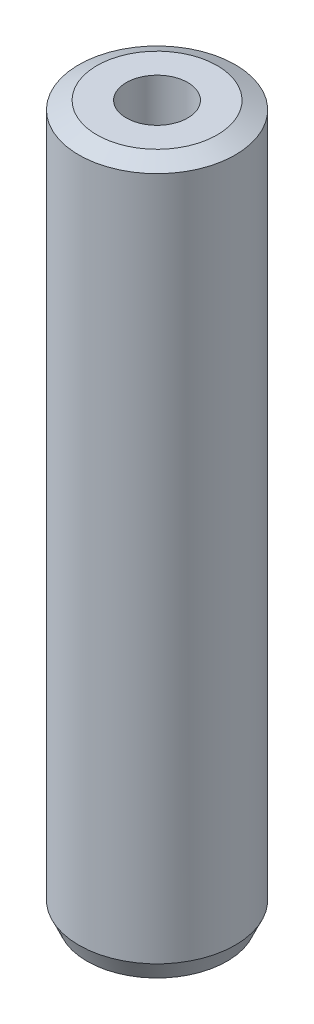
ISO-10303-21;
HEADER;
FILE_DESCRIPTION(('STEP AP214'),'2;1');
FILE_NAME('part.step','',(''),(''),'','','');
FILE_SCHEMA(('AUTOMOTIVE_DESIGN { 1 0 10303 214 1 1 1 1 }'));
ENDSEC;
DATA;
#1=APPLICATION_CONTEXT('core data for automotive mechanical design processes');
#2=APPLICATION_PROTOCOL_DEFINITION('international standard','automotive_design',2000,#1);
#3=PRODUCT_CONTEXT('',#1,'mechanical');
#4=PRODUCT('Part','Part','',(#3));
#5=PRODUCT_RELATED_PRODUCT_CATEGORY('part','',(#4));
#6=PRODUCT_DEFINITION_FORMATION('','',#4);
#7=PRODUCT_DEFINITION_CONTEXT('part definition',#1,'design');
#8=PRODUCT_DEFINITION('design','',#6,#7);
#9=PRODUCT_DEFINITION_SHAPE('','',#8);
#10=(LENGTH_UNIT() NAMED_UNIT(*) SI_UNIT(.MILLI.,.METRE.));
#11=(NAMED_UNIT(*) PLANE_ANGLE_UNIT() SI_UNIT($,.RADIAN.));
#12=(NAMED_UNIT(*) SI_UNIT($,.STERADIAN.) SOLID_ANGLE_UNIT());
#13=UNCERTAINTY_MEASURE_WITH_UNIT(LENGTH_MEASURE(1.E-05),#10,'distance_accuracy_value','');
#14=(GEOMETRIC_REPRESENTATION_CONTEXT(3) GLOBAL_UNCERTAINTY_ASSIGNED_CONTEXT((#13)) GLOBAL_UNIT_ASSIGNED_CONTEXT((#10,
#11,#12)) REPRESENTATION_CONTEXT('',''));
#15=CARTESIAN_POINT('',(0.,0.,0.));
#16=DIRECTION('',(0.,0.,1.));
#17=DIRECTION('',(1.,0.,0.));
#18=AXIS2_PLACEMENT_3D('',#15,#16,#17);
#19=CARTESIAN_POINT('',(0.,317.944374812962,0.));
#20=DIRECTION('',(0.,-1.,0.));
#21=DIRECTION('',(0.,0.,-1.));
#22=AXIS2_PLACEMENT_3D('',#19,#20,#21);
#23=CYLINDRICAL_SURFACE('',#22,35.);
#24=CARTESIAN_POINT('',(0.,314.234923446247,0.));
#25=DIRECTION('',(0.,1.,0.));
#26=DIRECTION('',(0.,0.,1.));
#27=AXIS2_PLACEMENT_3D('',#24,#25,#26);
#28=CIRCLE('',#27,35.);
#29=CARTESIAN_POINT('',(0.,314.234923446247,-35.0000000000001));
#30=VERTEX_POINT('',#29);
#31=EDGE_CURVE('E50',#30,#30,#28,.F.);
#32=ORIENTED_EDGE('',*,*,#31,.T.);
#33=EDGE_LOOP('',(#32));
#34=FACE_BOUND('',#33,.T.);
#35=CARTESIAN_POINT('',(0.,8.11050078247921,0.));
#36=DIRECTION('',(0.,1.,0.));
#37=DIRECTION('',(0.,0.,1.));
#38=AXIS2_PLACEMENT_3D('',#35,#36,#37);
#39=CIRCLE('',#38,35.);
#40=CARTESIAN_POINT('',(0.,8.11050078247921,35.));
#41=VERTEX_POINT('',#40);
#42=EDGE_CURVE('E51',#41,#41,#39,.T.);
#43=ORIENTED_EDGE('',*,*,#42,.T.);
#44=EDGE_LOOP('',(#43));
#45=FACE_BOUND('',#44,.T.);
#46=ADVANCED_FACE('F39',(#34,#45),#23,.T.);
#47=CARTESIAN_POINT('',(0.,317.944374812962,0.));
#48=DIRECTION('',(0.,1.,0.));
#49=DIRECTION('',(0.,0.,1.));
#50=AXIS2_PLACEMENT_3D('',#47,#48,#49);
#51=PLANE('',#50);
#52=CARTESIAN_POINT('',(0.,317.944374812962,0.));
#53=DIRECTION('',(0.,1.,0.));
#54=DIRECTION('',(0.,0.,1.));
#55=AXIS2_PLACEMENT_3D('',#52,#53,#54);
#56=CIRCLE('',#55,26.8894992175207);
#57=CARTESIAN_POINT('',(0.,317.944374812962,-26.8894992175207));
#58=VERTEX_POINT('',#57);
#59=EDGE_CURVE('E54',#58,#58,#56,.T.);
#60=ORIENTED_EDGE('',*,*,#59,.T.);
#61=EDGE_LOOP('',(#60));
#62=FACE_BOUND('',#61,.T.);
#63=CARTESIAN_POINT('',(0.,317.944374812962,0.));
#64=DIRECTION('',(0.,1.,0.));
#65=DIRECTION('',(0.,0.,1.));
#66=AXIS2_PLACEMENT_3D('',#63,#64,#65);
#67=CIRCLE('',#66,13.7501107790412);
#68=CARTESIAN_POINT('',(0.,317.944374812962,13.7501107790412));
#69=VERTEX_POINT('',#68);
#70=EDGE_CURVE('E58',#69,#69,#67,.T.);
#71=ORIENTED_EDGE('',*,*,#70,.F.);
#72=EDGE_LOOP('',(#71));
#73=FACE_BOUND('',#72,.T.);
#74=ADVANCED_FACE('F69',(#62,#73),#51,.T.);
#75=CARTESIAN_POINT('',(0.,0.,0.));
#76=DIRECTION('',(0.,1.,0.));
#77=DIRECTION('',(0.,0.,1.));
#78=AXIS2_PLACEMENT_3D('',#75,#76,#77);
#79=PLANE('',#78);
#80=CARTESIAN_POINT('',(0.,0.,0.));
#81=DIRECTION('',(0.,1.,0.));
#82=DIRECTION('',(0.,0.,1.));
#83=AXIS2_PLACEMENT_3D('',#80,#81,#82);
#84=CIRCLE('',#83,31.2905486332847);
#85=CARTESIAN_POINT('',(0.,0.,31.2905486332847));
#86=VERTEX_POINT('',#85);
#87=EDGE_CURVE('E10',#86,#86,#84,.F.);
#88=ORIENTED_EDGE('',*,*,#87,.T.);
#89=EDGE_LOOP('',(#88));
#90=FACE_BOUND('',#89,.T.);
#91=CARTESIAN_POINT('',(0.,0.,0.));
#92=DIRECTION('',(0.,1.,0.));
#93=DIRECTION('',(0.,0.,1.));
#94=AXIS2_PLACEMENT_3D('',#91,#92,#93);
#95=CIRCLE('',#94,13.7501107790412);
#96=CARTESIAN_POINT('',(0.,0.,13.7501107790412));
#97=VERTEX_POINT('',#96);
#98=EDGE_CURVE('E63',#97,#97,#95,.T.);
#99=ORIENTED_EDGE('',*,*,#98,.T.);
#100=EDGE_LOOP('',(#99));
#101=FACE_BOUND('',#100,.T.);
#102=ADVANCED_FACE('F75',(#90,#101),#79,.F.);
#103=CARTESIAN_POINT('',(0.,317.944374812962,0.));
#104=DIRECTION('',(0.,-1.,0.));
#105=DIRECTION('',(0.,0.,-1.));
#106=AXIS2_PLACEMENT_3D('',#103,#104,#105);
#107=CYLINDRICAL_SURFACE('',#106,13.7501107790412);
#108=ORIENTED_EDGE('',*,*,#70,.T.);
#109=EDGE_LOOP('',(#108));
#110=FACE_BOUND('',#109,.T.);
#111=ORIENTED_EDGE('',*,*,#98,.F.);
#112=EDGE_LOOP('',(#111));
#113=FACE_BOUND('',#112,.T.);
#114=ADVANCED_FACE('F70',(#110,#113),#107,.F.);
#115=CARTESIAN_POINT('',(0.,317.944374812962,0.));
#116=DIRECTION('',(0.,-1.,0.));
#117=DIRECTION('',(0.,0.,-1.));
#118=AXIS2_PLACEMENT_3D('',#115,#116,#117);
#119=CONICAL_SURFACE('',#118,26.8894992175207,1.14183536844898);
#120=CARTESIAN_POINT('',(0.,314.234923446247,-35.0000000000001));
#121=CARTESIAN_POINT('',(0.,314.27356356465,-34.9155156168492));
#122=CARTESIAN_POINT('',(0.,314.312203683054,-34.8310312336984));
#123=CARTESIAN_POINT('',(0.,314.38948391986,-34.6620624673968));
#124=CARTESIAN_POINT('',(0.,314.428124038264,-34.5775780842459));
#125=CARTESIAN_POINT('',(0.,314.50540427507,-34.4086093179443));
#126=CARTESIAN_POINT('',(0.,314.544044393473,-34.3241249347935));
#127=CARTESIAN_POINT('',(0.,314.62132463028,-34.1551561684918));
#128=CARTESIAN_POINT('',(0.,314.659964748683,-34.070671785341));
#129=CARTESIAN_POINT('',(0.,314.73724498549,-33.9017030190393));
#130=CARTESIAN_POINT('',(0.,314.775885103893,-33.8172186358885));
#131=CARTESIAN_POINT('',(0.,314.8531653407,-33.6482498695868));
#132=CARTESIAN_POINT('',(0.,314.891805459103,-33.563765486436));
#133=CARTESIAN_POINT('',(0.,314.969085695909,-33.3947967201344));
#134=CARTESIAN_POINT('',(0.,315.007725814313,-33.3103123369835));
#135=CARTESIAN_POINT('',(0.,315.085006051119,-33.1413435706819));
#136=CARTESIAN_POINT('',(0.,315.123646169523,-33.0568591875311));
#137=CARTESIAN_POINT('',(0.,315.200926406329,-32.8878904212294));
#138=CARTESIAN_POINT('',(0.,315.239566524732,-32.8034060380786));
#139=CARTESIAN_POINT('',(0.,315.316846761539,-32.6344372717769));
#140=CARTESIAN_POINT('',(0.,315.355486879942,-32.5499528886261));
#141=CARTESIAN_POINT('',(0.,315.432767116749,-32.3809841223244));
#142=CARTESIAN_POINT('',(0.,315.471407235152,-32.2964997391736));
#143=CARTESIAN_POINT('',(0.,315.548687471959,-32.127530972872));
#144=CARTESIAN_POINT('',(0.,315.587327590362,-32.0430465897211));
#145=CARTESIAN_POINT('',(0.,315.664607827169,-31.8740778234195));
#146=CARTESIAN_POINT('',(0.,315.703247945572,-31.7895934402687));
#147=CARTESIAN_POINT('',(0.,315.780528182378,-31.620624673967));
#148=CARTESIAN_POINT('',(0.,315.819168300782,-31.5361402908162));
#149=CARTESIAN_POINT('',(0.,315.896448537588,-31.3671715245145));
#150=CARTESIAN_POINT('',(0.,315.935088655992,-31.2826871413637));
#151=CARTESIAN_POINT('',(0.,316.012368892798,-31.113718375062));
#152=CARTESIAN_POINT('',(0.,316.051009011201,-31.0292339919112));
#153=CARTESIAN_POINT('',(0.,316.128289248008,-30.8602652256096));
#154=CARTESIAN_POINT('',(0.,316.166929366411,-30.7757808424587));
#155=CARTESIAN_POINT('',(0.,316.244209603218,-30.6068120761571));
#156=CARTESIAN_POINT('',(0.,316.282849721621,-30.5223276930063));
#157=CARTESIAN_POINT('',(0.,316.360129958428,-30.3533589267046));
#158=CARTESIAN_POINT('',(0.,316.398770076831,-30.2688745435538));
#159=CARTESIAN_POINT('',(0.,316.476050313638,-30.0999057772521));
#160=CARTESIAN_POINT('',(0.,316.514690432041,-30.0154213941013));
#161=CARTESIAN_POINT('',(0.,316.591970668847,-29.8464526277996));
#162=CARTESIAN_POINT('',(0.,316.630610787251,-29.7619682446488));
#163=CARTESIAN_POINT('',(0.,316.707891024057,-29.5929994783472));
#164=CARTESIAN_POINT('',(0.,316.746531142461,-29.5085150951963));
#165=CARTESIAN_POINT('',(0.,316.823811379267,-29.3395463288947));
#166=CARTESIAN_POINT('',(0.,316.86245149767,-29.2550619457439));
#167=CARTESIAN_POINT('',(0.,316.939731734477,-29.0860931794422));
#168=CARTESIAN_POINT('',(0.,316.97837185288,-29.0016087962914));
#169=CARTESIAN_POINT('',(0.,317.055652089687,-28.8326400299897));
#170=CARTESIAN_POINT('',(0.,317.09429220809,-28.7481556468389));
#171=CARTESIAN_POINT('',(0.,317.171572444897,-28.5791868805372));
#172=CARTESIAN_POINT('',(0.,317.2102125633,-28.4947024973864));
#173=CARTESIAN_POINT('',(0.,317.287492800107,-28.3257337310848));
#174=CARTESIAN_POINT('',(0.,317.32613291851,-28.2412493479339));
#175=CARTESIAN_POINT('',(0.,317.403413155316,-28.0722805816323));
#176=CARTESIAN_POINT('',(0.,317.44205327372,-27.9877961984815));
#177=CARTESIAN_POINT('',(0.,317.519333510526,-27.8188274321798));
#178=CARTESIAN_POINT('',(0.,317.55797362893,-27.734343049029));
#179=CARTESIAN_POINT('',(0.,317.635253865736,-27.5653742827273));
#180=CARTESIAN_POINT('',(0.,317.673893984139,-27.4808898995765));
#181=CARTESIAN_POINT('',(0.,317.751174220946,-27.3119211332748));
#182=CARTESIAN_POINT('',(0.,317.789814339349,-27.227436750124));
#183=CARTESIAN_POINT('',(0.,317.867094576156,-27.0584679838224));
#184=CARTESIAN_POINT('',(0.,317.905734694559,-26.9739836006715));
#185=CARTESIAN_POINT('',(0.,317.944374812962,-26.8894992175207));
#186=B_SPLINE_CURVE_WITH_KNOTS('',3,(#120,#121,#122,#123,#124,#125,#126,#127,#128,#129,#130,
#131,#132,#133,#134,#135,#136,#137,#138,#139,#140,#141,#142,#143,#144,#145,#146,#147,#148,#149,
#150,#151,#152,#153,#154,#155,#156,#157,#158,#159,#160,#161,#162,#163,#164,#165,#166,#167,#168,
#169,#170,#171,#172,#173,#174,#175,#176,#177,#178,#179,#180,#181,#182,#183,#184,#185),
.UNSPECIFIED.,.F.,.F.,(4,2,2,2,2,2,2,2,2,2,2,2,2,2,2,2,2,2,2,2,2,2,2,2,2,2,2,2,2,2,2,2,4),(0.,
0.278704193939308,0.557408387878615,0.836112581817922,1.11481677575723,1.39352096969654,
1.67222516363585,1.95092935757516,2.22963355151447,2.50833774545377,2.78704193939309,
3.0657461333324,3.34445032727173,3.62315452121101,3.90185871515034,4.18056290908963,
4.45926710302894,4.73797129696824,5.01667549090755,5.29537968484686,5.57408387878617,
5.85278807272548,6.13149226666479,6.41019646060409,6.68890065454343,6.96760484848274,
7.24630904242205,7.52501323636135,7.80371743030066,8.08242162423997,8.36112581817928,
8.63983001211859,8.9185342060579),.UNSPECIFIED.);
#187=EDGE_CURVE('BSEAM81',#30,#58,#186,.T.);
#188=ORIENTED_EDGE('',*,*,#31,.F.);
#189=ORIENTED_EDGE('',*,*,#59,.F.);
#190=ORIENTED_EDGE('',*,*,#187,.T.);
#191=ORIENTED_EDGE('',*,*,#187,.F.);
#192=EDGE_LOOP('',(#188,#190,#189,#191));
#193=FACE_BOUND('',#192,.T.);
#194=ADVANCED_FACE('F81',(#193),#119,.T.);
#195=CARTESIAN_POINT('',(0.,8.11050078247921,0.));
#196=DIRECTION('',(0.,1.,0.));
#197=DIRECTION('',(0.,0.,1.));
#198=AXIS2_PLACEMENT_3D('',#195,#196,#197);
#199=CONICAL_SURFACE('',#198,35.,0.428960958345926);
#200=ORIENTED_EDGE('',*,*,#87,.F.);
#201=EDGE_LOOP('',(#200));
#202=FACE_BOUND('',#201,.T.);
#203=ORIENTED_EDGE('',*,*,#42,.F.);
#204=EDGE_LOOP('',(#203));
#205=FACE_BOUND('',#204,.T.);
#206=ADVANCED_FACE('F45',(#202,#205),#199,.T.);
#207=CLOSED_SHELL('',(#46,#74,#102,#114,#194,#206));
#208=MANIFOLD_SOLID_BREP('B2',#207);
#209=ADVANCED_BREP_SHAPE_REPRESENTATION('',(#18,#208),#14);
#210=SHAPE_DEFINITION_REPRESENTATION(#9,#209);
ENDSEC;
END-ISO-10303-21;
